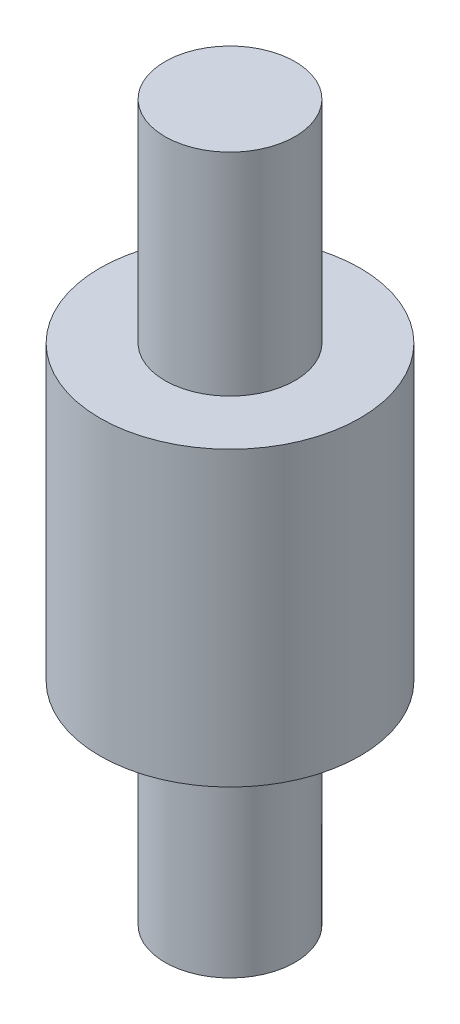
ISO-10303-21;
HEADER;
FILE_DESCRIPTION(('STEP AP214'),'2;1');
FILE_NAME('part.step','',(''),(''),'','','');
FILE_SCHEMA(('AUTOMOTIVE_DESIGN { 1 0 10303 214 1 1 1 1 }'));
ENDSEC;
DATA;
#1=APPLICATION_CONTEXT('core data for automotive mechanical design processes');
#2=APPLICATION_PROTOCOL_DEFINITION('international standard','automotive_design',2000,#1);
#3=PRODUCT_CONTEXT('',#1,'mechanical');
#4=PRODUCT('Part','Part','',(#3));
#5=PRODUCT_RELATED_PRODUCT_CATEGORY('part','',(#4));
#6=PRODUCT_DEFINITION_FORMATION('','',#4);
#7=PRODUCT_DEFINITION_CONTEXT('part definition',#1,'design');
#8=PRODUCT_DEFINITION('design','',#6,#7);
#9=PRODUCT_DEFINITION_SHAPE('','',#8);
#10=(LENGTH_UNIT() NAMED_UNIT(*) SI_UNIT(.MILLI.,.METRE.));
#11=(NAMED_UNIT(*) PLANE_ANGLE_UNIT() SI_UNIT($,.RADIAN.));
#12=(NAMED_UNIT(*) SI_UNIT($,.STERADIAN.) SOLID_ANGLE_UNIT());
#13=UNCERTAINTY_MEASURE_WITH_UNIT(LENGTH_MEASURE(1.E-05),#10,'distance_accuracy_value','');
#14=(GEOMETRIC_REPRESENTATION_CONTEXT(3) GLOBAL_UNCERTAINTY_ASSIGNED_CONTEXT((#13)) GLOBAL_UNIT_ASSIGNED_CONTEXT((#10,
#11,#12)) REPRESENTATION_CONTEXT('',''));
#15=CARTESIAN_POINT('',(0.,0.,0.));
#16=DIRECTION('',(0.,0.,1.));
#17=DIRECTION('',(1.,0.,0.));
#18=AXIS2_PLACEMENT_3D('',#15,#16,#17);
#19=CARTESIAN_POINT('',(0.,18.,0.));
#20=DIRECTION('',(0.,-1.,0.));
#21=DIRECTION('',(0.,0.,-1.));
#22=AXIS2_PLACEMENT_3D('',#19,#20,#21);
#23=CYLINDRICAL_SURFACE('',#22,8.);
#24=CARTESIAN_POINT('',(0.,18.,0.));
#25=DIRECTION('',(0.,1.,0.));
#26=DIRECTION('',(0.,0.,1.));
#27=AXIS2_PLACEMENT_3D('',#24,#25,#26);
#28=CIRCLE('',#27,8.);
#29=CARTESIAN_POINT('',(0.,18.,8.));
#30=VERTEX_POINT('',#29);
#31=EDGE_CURVE('E51',#30,#30,#28,.T.);
#32=ORIENTED_EDGE('',*,*,#31,.F.);
#33=EDGE_LOOP('',(#32));
#34=FACE_BOUND('',#33,.T.);
#35=CARTESIAN_POINT('',(0.,0.,0.));
#36=DIRECTION('',(0.,1.,0.));
#37=DIRECTION('',(0.,0.,1.));
#38=AXIS2_PLACEMENT_3D('',#35,#36,#37);
#39=CIRCLE('',#38,8.);
#40=CARTESIAN_POINT('',(0.,0.,8.));
#41=VERTEX_POINT('',#40);
#42=EDGE_CURVE('E40',#41,#41,#39,.T.);
#43=ORIENTED_EDGE('',*,*,#42,.T.);
#44=EDGE_LOOP('',(#43));
#45=FACE_BOUND('',#44,.T.);
#46=ADVANCED_FACE('F37',(#34,#45),#23,.T.);
#47=CARTESIAN_POINT('',(0.,18.,0.));
#48=DIRECTION('',(0.,1.,0.));
#49=DIRECTION('',(0.,0.,1.));
#50=AXIS2_PLACEMENT_3D('',#47,#48,#49);
#51=PLANE('',#50);
#52=CARTESIAN_POINT('',(0.,18.,0.));
#53=DIRECTION('',(0.,1.,0.));
#54=DIRECTION('',(0.,0.,1.));
#55=AXIS2_PLACEMENT_3D('',#52,#53,#54);
#56=CIRCLE('',#55,4.);
#57=CARTESIAN_POINT('',(0.,18.,4.));
#58=VERTEX_POINT('',#57);
#59=EDGE_CURVE('E45',#58,#58,#56,.T.);
#60=ORIENTED_EDGE('',*,*,#59,.F.);
#61=EDGE_LOOP('',(#60));
#62=FACE_BOUND('',#61,.T.);
#63=ORIENTED_EDGE('',*,*,#31,.T.);
#64=EDGE_LOOP('',(#63));
#65=FACE_BOUND('',#64,.T.);
#66=ADVANCED_FACE('F71',(#62,#65),#51,.T.);
#67=CARTESIAN_POINT('',(0.,0.,0.));
#68=DIRECTION('',(0.,1.,0.));
#69=DIRECTION('',(0.,0.,1.));
#70=AXIS2_PLACEMENT_3D('',#67,#68,#69);
#71=PLANE('',#70);
#72=CARTESIAN_POINT('',(0.,0.,0.));
#73=DIRECTION('',(0.,-1.,0.));
#74=DIRECTION('',(0.,0.,-1.));
#75=AXIS2_PLACEMENT_3D('',#72,#73,#74);
#76=CIRCLE('',#75,4.);
#77=CARTESIAN_POINT('',(0.,0.,-4.));
#78=VERTEX_POINT('',#77);
#79=EDGE_CURVE('E10',#78,#78,#76,.T.);
#80=ORIENTED_EDGE('',*,*,#79,.F.);
#81=EDGE_LOOP('',(#80));
#82=FACE_BOUND('',#81,.T.);
#83=ORIENTED_EDGE('',*,*,#42,.F.);
#84=EDGE_LOOP('',(#83));
#85=FACE_BOUND('',#84,.T.);
#86=ADVANCED_FACE('F68',(#82,#85),#71,.F.);
#87=CARTESIAN_POINT('',(0.,31.,0.));
#88=DIRECTION('',(0.,-1.,0.));
#89=DIRECTION('',(0.,0.,-1.));
#90=AXIS2_PLACEMENT_3D('',#87,#88,#89);
#91=CYLINDRICAL_SURFACE('',#90,4.);
#92=CARTESIAN_POINT('',(0.,31.,0.));
#93=DIRECTION('',(0.,1.,0.));
#94=DIRECTION('',(0.,0.,1.));
#95=AXIS2_PLACEMENT_3D('',#92,#93,#94);
#96=CIRCLE('',#95,4.);
#97=CARTESIAN_POINT('',(0.,31.,4.));
#98=VERTEX_POINT('',#97);
#99=EDGE_CURVE('E56',#98,#98,#96,.T.);
#100=ORIENTED_EDGE('',*,*,#99,.F.);
#101=EDGE_LOOP('',(#100));
#102=FACE_BOUND('',#101,.T.);
#103=ORIENTED_EDGE('',*,*,#59,.T.);
#104=EDGE_LOOP('',(#103));
#105=FACE_BOUND('',#104,.T.);
#106=ADVANCED_FACE('F70',(#102,#105),#91,.T.);
#107=CARTESIAN_POINT('',(0.,31.,0.));
#108=DIRECTION('',(0.,1.,0.));
#109=DIRECTION('',(0.,0.,1.));
#110=AXIS2_PLACEMENT_3D('',#107,#108,#109);
#111=PLANE('',#110);
#112=ORIENTED_EDGE('',*,*,#99,.T.);
#113=EDGE_LOOP('',(#112));
#114=FACE_BOUND('',#113,.T.);
#115=ADVANCED_FACE('F77',(#114),#111,.T.);
#116=CARTESIAN_POINT('',(0.,-13.,0.));
#117=DIRECTION('',(0.,1.,0.));
#118=DIRECTION('',(0.,0.,1.));
#119=AXIS2_PLACEMENT_3D('',#116,#117,#118);
#120=CYLINDRICAL_SURFACE('',#119,4.);
#121=CARTESIAN_POINT('',(0.,-13.,0.));
#122=DIRECTION('',(0.,-1.,0.));
#123=DIRECTION('',(0.,0.,-1.));
#124=AXIS2_PLACEMENT_3D('',#121,#122,#123);
#125=CIRCLE('',#124,4.);
#126=CARTESIAN_POINT('',(0.,-13.,-4.));
#127=VERTEX_POINT('',#126);
#128=EDGE_CURVE('E55',#127,#127,#125,.T.);
#129=ORIENTED_EDGE('',*,*,#128,.F.);
#130=EDGE_LOOP('',(#129));
#131=FACE_BOUND('',#130,.T.);
#132=ORIENTED_EDGE('',*,*,#79,.T.);
#133=EDGE_LOOP('',(#132));
#134=FACE_BOUND('',#133,.T.);
#135=ADVANCED_FACE('F105',(#131,#134),#120,.T.);
#136=CARTESIAN_POINT('',(0.,-13.,0.));
#137=DIRECTION('',(0.,-1.,0.));
#138=DIRECTION('',(0.,0.,-1.));
#139=AXIS2_PLACEMENT_3D('',#136,#137,#138);
#140=PLANE('',#139);
#141=ORIENTED_EDGE('',*,*,#128,.T.);
#142=EDGE_LOOP('',(#141));
#143=FACE_BOUND('',#142,.T.);
#144=ADVANCED_FACE('F119',(#143),#140,.T.);
#145=CLOSED_SHELL('',(#46,#66,#86,#106,#115,#135,#144));
#146=MANIFOLD_SOLID_BREP('B2',#145);
#147=ADVANCED_BREP_SHAPE_REPRESENTATION('',(#18,#146),#14);
#148=SHAPE_DEFINITION_REPRESENTATION(#9,#147);
ENDSEC;
END-ISO-10303-21;
